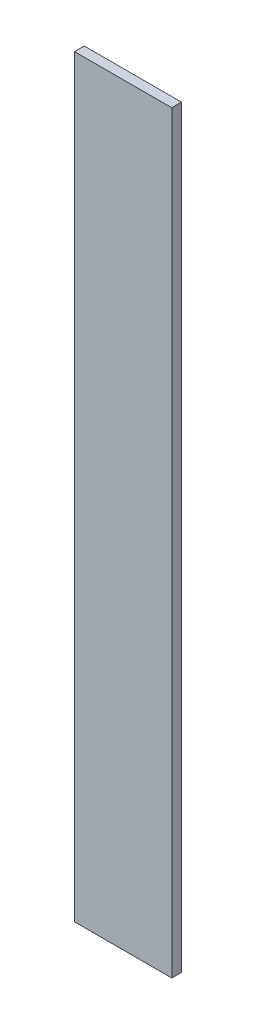
ISO-10303-21;
HEADER;
FILE_DESCRIPTION(('STEP AP214'),'2;1');
FILE_NAME('part.step','',(''),(''),'','','');
FILE_SCHEMA(('AUTOMOTIVE_DESIGN { 1 0 10303 214 1 1 1 1 }'));
ENDSEC;
DATA;
#1=APPLICATION_CONTEXT('core data for automotive mechanical design processes');
#2=APPLICATION_PROTOCOL_DEFINITION('international standard','automotive_design',2000,#1);
#3=PRODUCT_CONTEXT('',#1,'mechanical');
#4=PRODUCT('Part','Part','',(#3));
#5=PRODUCT_RELATED_PRODUCT_CATEGORY('part','',(#4));
#6=PRODUCT_DEFINITION_FORMATION('','',#4);
#7=PRODUCT_DEFINITION_CONTEXT('part definition',#1,'design');
#8=PRODUCT_DEFINITION('design','',#6,#7);
#9=PRODUCT_DEFINITION_SHAPE('','',#8);
#10=(LENGTH_UNIT() NAMED_UNIT(*) SI_UNIT(.MILLI.,.METRE.));
#11=(NAMED_UNIT(*) PLANE_ANGLE_UNIT() SI_UNIT($,.RADIAN.));
#12=(NAMED_UNIT(*) SI_UNIT($,.STERADIAN.) SOLID_ANGLE_UNIT());
#13=UNCERTAINTY_MEASURE_WITH_UNIT(LENGTH_MEASURE(1.E-05),#10,'distance_accuracy_value','');
#14=(GEOMETRIC_REPRESENTATION_CONTEXT(3) GLOBAL_UNCERTAINTY_ASSIGNED_CONTEXT((#13)) GLOBAL_UNIT_ASSIGNED_CONTEXT((#10,
#11,#12)) REPRESENTATION_CONTEXT('',''));
#15=CARTESIAN_POINT('',(0.,0.,0.));
#16=DIRECTION('',(0.,0.,1.));
#17=DIRECTION('',(1.,0.,0.));
#18=AXIS2_PLACEMENT_3D('',#15,#16,#17);
#19=CARTESIAN_POINT('',(-129.608938547486,1550.,-67.4581005586592));
#20=DIRECTION('',(1.,0.,0.));
#21=DIRECTION('',(0.,0.,-1.));
#22=AXIS2_PLACEMENT_3D('',#19,#20,#21);
#23=PLANE('',#22);
#24=DIRECTION('',(0.,0.,1.));
#25=VECTOR('',#24,1.);
#26=CARTESIAN_POINT('',(-129.608938547486,0.,-67.4581005586592));
#27=LINE('',#26,#25);
#28=CARTESIAN_POINT('',(-129.608938547486,0.,-67.4581005586592));
#29=VERTEX_POINT('',#28);
#30=CARTESIAN_POINT('',(-129.608938547486,0.,-47.4581005586592));
#31=VERTEX_POINT('',#30);
#32=EDGE_CURVE('E96',#29,#31,#27,.T.);
#33=ORIENTED_EDGE('',*,*,#32,.T.);
#34=DIRECTION('',(0.,-1.,0.));
#35=VECTOR('',#34,1.);
#36=CARTESIAN_POINT('',(-129.608938547486,1550.,-47.4581005586592));
#37=LINE('',#36,#35);
#38=CARTESIAN_POINT('',(-129.608938547486,1550.,-47.4581005586592));
#39=VERTEX_POINT('',#38);
#40=EDGE_CURVE('E11',#39,#31,#37,.T.);
#41=ORIENTED_EDGE('',*,*,#40,.F.);
#42=DIRECTION('',(0.,0.,1.));
#43=VECTOR('',#42,1.);
#44=CARTESIAN_POINT('',(-129.608938547486,1550.,-67.4581005586592));
#45=LINE('',#44,#43);
#46=CARTESIAN_POINT('',(-129.608938547486,1550.,-67.4581005586592));
#47=VERTEX_POINT('',#46);
#48=EDGE_CURVE('E84',#47,#39,#45,.T.);
#49=ORIENTED_EDGE('',*,*,#48,.F.);
#50=DIRECTION('',(0.,-1.,0.));
#51=VECTOR('',#50,1.);
#52=CARTESIAN_POINT('',(-129.608938547486,1550.,-67.4581005586592));
#53=LINE('',#52,#51);
#54=EDGE_CURVE('E92',#47,#29,#53,.T.);
#55=ORIENTED_EDGE('',*,*,#54,.T.);
#56=EDGE_LOOP('',(#33,#41,#49,#55));
#57=FACE_BOUND('',#56,.T.);
#58=ADVANCED_FACE('F33',(#57),#23,.F.);
#59=CARTESIAN_POINT('',(-129.608938547486,1550.,-47.4581005586592));
#60=DIRECTION('',(0.,0.,-1.));
#61=DIRECTION('',(-1.,0.,0.));
#62=AXIS2_PLACEMENT_3D('',#59,#60,#61);
#63=PLANE('',#62);
#64=DIRECTION('',(1.,0.,0.));
#65=VECTOR('',#64,1.);
#66=CARTESIAN_POINT('',(-129.608938547486,0.,-47.4581005586592));
#67=LINE('',#66,#65);
#68=CARTESIAN_POINT('',(70.3910614525139,0.,-47.4581005586592));
#69=VERTEX_POINT('',#68);
#70=EDGE_CURVE('E88',#31,#69,#67,.T.);
#71=ORIENTED_EDGE('',*,*,#70,.T.);
#72=DIRECTION('',(0.,-1.,0.));
#73=VECTOR('',#72,1.);
#74=CARTESIAN_POINT('',(70.3910614525139,1550.,-47.4581005586592));
#75=LINE('',#74,#73);
#76=CARTESIAN_POINT('',(70.3910614525139,1550.,-47.4581005586592));
#77=VERTEX_POINT('',#76);
#78=EDGE_CURVE('E41',#77,#69,#75,.T.);
#79=ORIENTED_EDGE('',*,*,#78,.F.);
#80=DIRECTION('',(1.,0.,0.));
#81=VECTOR('',#80,1.);
#82=CARTESIAN_POINT('',(-129.608938547486,1550.,-47.4581005586592));
#83=LINE('',#82,#81);
#84=EDGE_CURVE('E79',#39,#77,#83,.T.);
#85=ORIENTED_EDGE('',*,*,#84,.F.);
#86=ORIENTED_EDGE('',*,*,#40,.T.);
#87=EDGE_LOOP('',(#71,#79,#85,#86));
#88=FACE_BOUND('',#87,.T.);
#89=ADVANCED_FACE('F87',(#88),#63,.F.);
#90=CARTESIAN_POINT('',(70.3910614525139,1550.,-67.4581005586592));
#91=DIRECTION('',(-1.,0.,0.));
#92=DIRECTION('',(0.,0.,1.));
#93=AXIS2_PLACEMENT_3D('',#90,#91,#92);
#94=PLANE('',#93);
#95=DIRECTION('',(0.,0.,-1.));
#96=VECTOR('',#95,1.);
#97=CARTESIAN_POINT('',(70.3910614525139,0.,-67.4581005586592));
#98=LINE('',#97,#96);
#99=CARTESIAN_POINT('',(70.3910614525139,0.,-67.4581005586592));
#100=VERTEX_POINT('',#99);
#101=EDGE_CURVE('E66',#69,#100,#98,.T.);
#102=ORIENTED_EDGE('',*,*,#101,.T.);
#103=DIRECTION('',(0.,-1.,0.));
#104=VECTOR('',#103,1.);
#105=CARTESIAN_POINT('',(70.3910614525139,1550.,-67.4581005586592));
#106=LINE('',#105,#104);
#107=CARTESIAN_POINT('',(70.3910614525139,1550.,-67.4581005586592));
#108=VERTEX_POINT('',#107);
#109=EDGE_CURVE('E89',#108,#100,#106,.T.);
#110=ORIENTED_EDGE('',*,*,#109,.F.);
#111=DIRECTION('',(0.,0.,-1.));
#112=VECTOR('',#111,1.);
#113=CARTESIAN_POINT('',(70.3910614525139,1550.,-67.4581005586592));
#114=LINE('',#113,#112);
#115=EDGE_CURVE('E82',#77,#108,#114,.T.);
#116=ORIENTED_EDGE('',*,*,#115,.F.);
#117=ORIENTED_EDGE('',*,*,#78,.T.);
#118=EDGE_LOOP('',(#102,#110,#116,#117));
#119=FACE_BOUND('',#118,.T.);
#120=ADVANCED_FACE('F90',(#119),#94,.F.);
#121=CARTESIAN_POINT('',(-129.608938547486,1550.,-67.4581005586592));
#122=DIRECTION('',(0.,0.,1.));
#123=DIRECTION('',(1.,0.,0.));
#124=AXIS2_PLACEMENT_3D('',#121,#122,#123);
#125=PLANE('',#124);
#126=DIRECTION('',(-1.,0.,0.));
#127=VECTOR('',#126,1.);
#128=CARTESIAN_POINT('',(-129.608938547486,0.,-67.4581005586592));
#129=LINE('',#128,#127);
#130=EDGE_CURVE('E72',#100,#29,#129,.T.);
#131=ORIENTED_EDGE('',*,*,#130,.T.);
#132=ORIENTED_EDGE('',*,*,#54,.F.);
#133=DIRECTION('',(-1.,0.,0.));
#134=VECTOR('',#133,1.);
#135=CARTESIAN_POINT('',(-129.608938547486,1550.,-67.4581005586592));
#136=LINE('',#135,#134);
#137=EDGE_CURVE('E49',#108,#47,#136,.T.);
#138=ORIENTED_EDGE('',*,*,#137,.F.);
#139=ORIENTED_EDGE('',*,*,#109,.T.);
#140=EDGE_LOOP('',(#131,#132,#138,#139));
#141=FACE_BOUND('',#140,.T.);
#142=ADVANCED_FACE('F103',(#141),#125,.F.);
#143=CARTESIAN_POINT('',(0.,1550.,0.));
#144=DIRECTION('',(0.,1.,0.));
#145=DIRECTION('',(0.,0.,1.));
#146=AXIS2_PLACEMENT_3D('',#143,#144,#145);
#147=PLANE('',#146);
#148=ORIENTED_EDGE('',*,*,#48,.T.);
#149=ORIENTED_EDGE('',*,*,#84,.T.);
#150=ORIENTED_EDGE('',*,*,#115,.T.);
#151=ORIENTED_EDGE('',*,*,#137,.T.);
#152=EDGE_LOOP('',(#148,#149,#150,#151));
#153=FACE_BOUND('',#152,.T.);
#154=ADVANCED_FACE('F80',(#153),#147,.T.);
#155=CARTESIAN_POINT('',(0.,0.,0.));
#156=DIRECTION('',(0.,1.,0.));
#157=DIRECTION('',(0.,0.,1.));
#158=AXIS2_PLACEMENT_3D('',#155,#156,#157);
#159=PLANE('',#158);
#160=ORIENTED_EDGE('',*,*,#32,.F.);
#161=ORIENTED_EDGE('',*,*,#130,.F.);
#162=ORIENTED_EDGE('',*,*,#101,.F.);
#163=ORIENTED_EDGE('',*,*,#70,.F.);
#164=EDGE_LOOP('',(#160,#161,#162,#163));
#165=FACE_BOUND('',#164,.T.);
#166=ADVANCED_FACE('F106',(#165),#159,.F.);
#167=CLOSED_SHELL('',(#58,#89,#120,#142,#154,#166));
#168=MANIFOLD_SOLID_BREP('B2',#167);
#169=ADVANCED_BREP_SHAPE_REPRESENTATION('',(#18,#168),#14);
#170=SHAPE_DEFINITION_REPRESENTATION(#9,#169);
ENDSEC;
END-ISO-10303-21;
